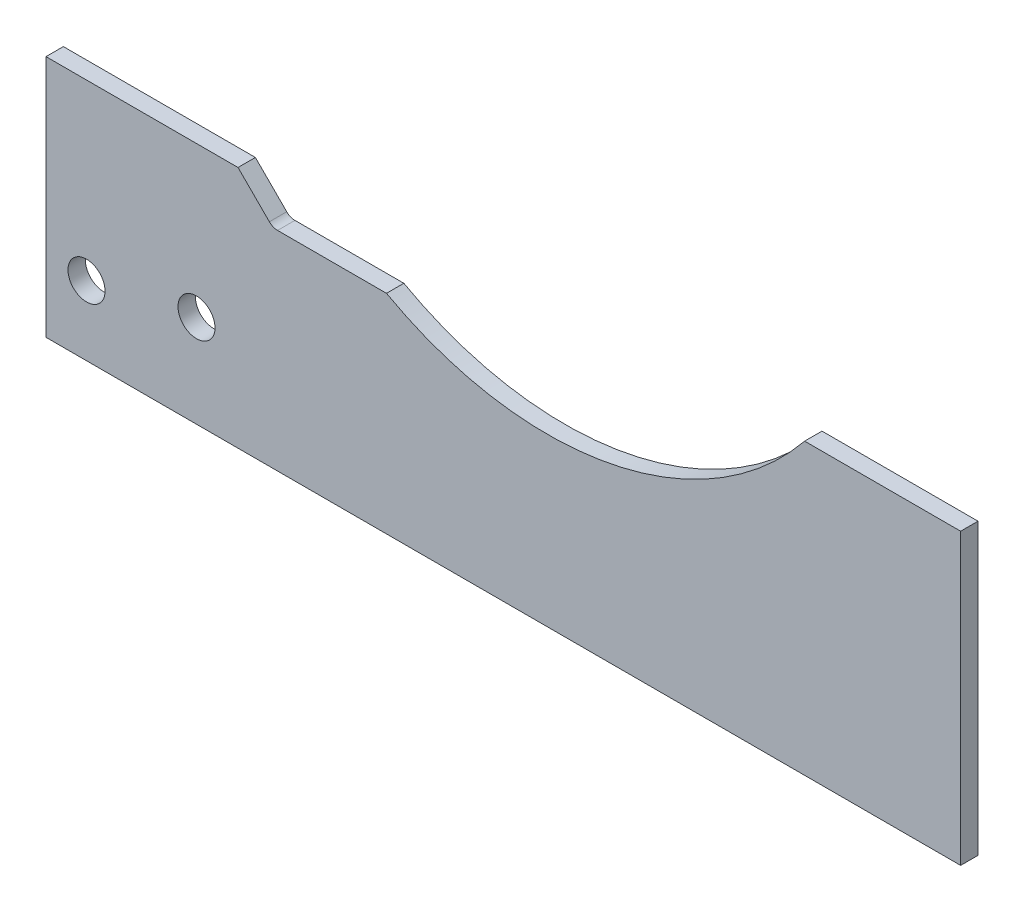
ISO-10303-21;
HEADER;
FILE_DESCRIPTION(('STEP AP214'),'2;1');
FILE_NAME('part.step','',(''),(''),'','','');
FILE_SCHEMA(('AUTOMOTIVE_DESIGN { 1 0 10303 214 1 1 1 1 }'));
ENDSEC;
DATA;
#1=APPLICATION_CONTEXT('core data for automotive mechanical design processes');
#2=APPLICATION_PROTOCOL_DEFINITION('international standard','automotive_design',2000,#1);
#3=PRODUCT_CONTEXT('',#1,'mechanical');
#4=PRODUCT('Part','Part','',(#3));
#5=PRODUCT_RELATED_PRODUCT_CATEGORY('part','',(#4));
#6=PRODUCT_DEFINITION_FORMATION('','',#4);
#7=PRODUCT_DEFINITION_CONTEXT('part definition',#1,'design');
#8=PRODUCT_DEFINITION('design','',#6,#7);
#9=PRODUCT_DEFINITION_SHAPE('','',#8);
#10=(LENGTH_UNIT() NAMED_UNIT(*) SI_UNIT(.MILLI.,.METRE.));
#11=(NAMED_UNIT(*) PLANE_ANGLE_UNIT() SI_UNIT($,.RADIAN.));
#12=(NAMED_UNIT(*) SI_UNIT($,.STERADIAN.) SOLID_ANGLE_UNIT());
#13=UNCERTAINTY_MEASURE_WITH_UNIT(LENGTH_MEASURE(1.E-05),#10,'distance_accuracy_value','');
#14=(GEOMETRIC_REPRESENTATION_CONTEXT(3) GLOBAL_UNCERTAINTY_ASSIGNED_CONTEXT((#13)) GLOBAL_UNIT_ASSIGNED_CONTEXT((#10,
#11,#12)) REPRESENTATION_CONTEXT('',''));
#15=CARTESIAN_POINT('',(0.,0.,0.));
#16=DIRECTION('',(0.,0.,1.));
#17=DIRECTION('',(1.,0.,0.));
#18=AXIS2_PLACEMENT_3D('',#15,#16,#17);
#19=CARTESIAN_POINT('',(20.0002128394422,19.0000000357668,1.5));
#20=DIRECTION('',(0.,0.,1.));
#21=DIRECTION('',(1.,0.,0.));
#22=AXIS2_PLACEMENT_3D('',#19,#20,#21);
#23=PLANE('',#22);
#24=CARTESIAN_POINT('',(3.5,6.,1.5));
#25=DIRECTION('',(0.,0.,1.));
#26=DIRECTION('',(1.,0.,0.));
#27=AXIS2_PLACEMENT_3D('',#24,#25,#26);
#28=CIRCLE('',#27,1.6);
#29=CARTESIAN_POINT('',(5.1,6.,1.5));
#30=VERTEX_POINT('',#29);
#31=EDGE_CURVE('E137',#30,#30,#28,.T.);
#32=ORIENTED_EDGE('',*,*,#31,.F.);
#33=EDGE_LOOP('',(#32));
#34=FACE_BOUND('',#33,.T.);
#35=CARTESIAN_POINT('',(20.0002128394422,19.0000000357668,1.5));
#36=DIRECTION('',(0.,0.,-1.));
#37=DIRECTION('',(1.,0.,0.));
#38=AXIS2_PLACEMENT_3D('',#35,#36,#37);
#39=CIRCLE('',#38,1.00000047576684);
#40=CARTESIAN_POINT('',(20.0002128394422,17.99999956,1.5));
#41=VERTEX_POINT('',#40);
#42=CARTESIAN_POINT('',(19.2931057218377,18.2928929181623,1.5));
#43=VERTEX_POINT('',#42);
#44=EDGE_CURVE('E150',#41,#43,#39,.T.);
#45=ORIENTED_EDGE('',*,*,#44,.T.);
#46=DIRECTION('',(-0.707106781186549,0.707106781186546,0.));
#47=VECTOR('',#46,1.);
#48=CARTESIAN_POINT('',(16.586,20.99999864,1.5));
#49=LINE('',#48,#47);
#50=CARTESIAN_POINT('',(16.586,20.99999864,1.5));
#51=VERTEX_POINT('',#50);
#52=EDGE_CURVE('E93',#43,#51,#49,.T.);
#53=ORIENTED_EDGE('',*,*,#52,.T.);
#54=DIRECTION('',(-1.,0.,0.));
#55=VECTOR('',#54,1.);
#56=CARTESIAN_POINT('',(0.,20.99999864,1.5));
#57=LINE('',#56,#55);
#58=CARTESIAN_POINT('',(0.,20.99999864,1.5));
#59=VERTEX_POINT('',#58);
#60=EDGE_CURVE('E168',#51,#59,#57,.T.);
#61=ORIENTED_EDGE('',*,*,#60,.T.);
#62=DIRECTION('',(0.,-1.,0.));
#63=VECTOR('',#62,1.);
#64=CARTESIAN_POINT('',(0.,20.99999864,1.5));
#65=LINE('',#64,#63);
#66=CARTESIAN_POINT('',(0.,0.,1.5));
#67=VERTEX_POINT('',#66);
#68=EDGE_CURVE('E185',#59,#67,#65,.T.);
#69=ORIENTED_EDGE('',*,*,#68,.T.);
#70=DIRECTION('',(1.,0.,0.));
#71=VECTOR('',#70,1.);
#72=CARTESIAN_POINT('',(0.,0.,1.5));
#73=LINE('',#72,#71);
#74=CARTESIAN_POINT('',(79.,0.,1.5));
#75=VERTEX_POINT('',#74);
#76=EDGE_CURVE('E184',#67,#75,#73,.T.);
#77=ORIENTED_EDGE('',*,*,#76,.T.);
#78=DIRECTION('',(0.,1.,0.));
#79=VECTOR('',#78,1.);
#80=CARTESIAN_POINT('',(79.,0.,1.5));
#81=LINE('',#80,#79);
#82=CARTESIAN_POINT('',(79.,25.0000008,1.5));
#83=VERTEX_POINT('',#82);
#84=EDGE_CURVE('E115',#75,#83,#81,.T.);
#85=ORIENTED_EDGE('',*,*,#84,.T.);
#86=DIRECTION('',(-1.,0.,0.));
#87=VECTOR('',#86,1.);
#88=CARTESIAN_POINT('',(79.,25.0000008,1.5));
#89=LINE('',#88,#87);
#90=CARTESIAN_POINT('',(65.5252115580482,25.0000008,1.5));
#91=VERTEX_POINT('',#90);
#92=EDGE_CURVE('E109',#83,#91,#89,.T.);
#93=ORIENTED_EDGE('',*,*,#92,.T.);
#94=CARTESIAN_POINT('',(43.3,43.,1.5));
#95=DIRECTION('',(0.,0.,-1.));
#96=DIRECTION('',(1.,0.,0.));
#97=AXIS2_PLACEMENT_3D('',#94,#95,#96);
#98=CIRCLE('',#97,28.6);
#99=CARTESIAN_POINT('',(29.4089965085312,17.99999956,1.5));
#100=VERTEX_POINT('',#99);
#101=EDGE_CURVE('E113',#91,#100,#98,.T.);
#102=ORIENTED_EDGE('',*,*,#101,.T.);
#103=DIRECTION('',(-1.,0.,0.));
#104=VECTOR('',#103,1.);
#105=CARTESIAN_POINT('',(20.0002128394422,17.99999956,1.5));
#106=LINE('',#105,#104);
#107=EDGE_CURVE('E47',#100,#41,#106,.T.);
#108=ORIENTED_EDGE('',*,*,#107,.T.);
#109=EDGE_LOOP('',(#45,#53,#61,#69,#77,#85,#93,#102,#108));
#110=FACE_BOUND('',#109,.T.);
#111=CARTESIAN_POINT('',(13.,8.,1.5));
#112=DIRECTION('',(0.,0.,1.));
#113=DIRECTION('',(1.,0.,0.));
#114=AXIS2_PLACEMENT_3D('',#111,#112,#113);
#115=CIRCLE('',#114,1.6);
#116=CARTESIAN_POINT('',(14.6,8.,1.5));
#117=VERTEX_POINT('',#116);
#118=EDGE_CURVE('E195',#117,#117,#115,.T.);
#119=ORIENTED_EDGE('',*,*,#118,.F.);
#120=EDGE_LOOP('',(#119));
#121=FACE_BOUND('',#120,.T.);
#122=ADVANCED_FACE('F30',(#34,#110,#121),#23,.T.);
#123=CARTESIAN_POINT('',(20.0002128394422,19.0000000357668,0.));
#124=DIRECTION('',(0.,0.,1.));
#125=DIRECTION('',(1.,0.,0.));
#126=AXIS2_PLACEMENT_3D('',#123,#124,#125);
#127=PLANE('',#126);
#128=CARTESIAN_POINT('',(3.5,6.,0.));
#129=DIRECTION('',(0.,0.,1.));
#130=DIRECTION('',(1.,0.,0.));
#131=AXIS2_PLACEMENT_3D('',#128,#129,#130);
#132=CIRCLE('',#131,1.6);
#133=CARTESIAN_POINT('',(5.1,6.,0.));
#134=VERTEX_POINT('',#133);
#135=EDGE_CURVE('E192',#134,#134,#132,.T.);
#136=ORIENTED_EDGE('',*,*,#135,.T.);
#137=EDGE_LOOP('',(#136));
#138=FACE_BOUND('',#137,.T.);
#139=CARTESIAN_POINT('',(20.0002128394422,19.0000000357668,0.));
#140=DIRECTION('',(0.,0.,-1.));
#141=DIRECTION('',(1.,0.,0.));
#142=AXIS2_PLACEMENT_3D('',#139,#140,#141);
#143=CIRCLE('',#142,1.00000047576684);
#144=CARTESIAN_POINT('',(20.0002128394422,17.99999956,0.));
#145=VERTEX_POINT('',#144);
#146=CARTESIAN_POINT('',(19.2931057218377,18.2928929181623,0.));
#147=VERTEX_POINT('',#146);
#148=EDGE_CURVE('E133',#145,#147,#143,.T.);
#149=ORIENTED_EDGE('',*,*,#148,.F.);
#150=DIRECTION('',(-1.,0.,0.));
#151=VECTOR('',#150,1.);
#152=CARTESIAN_POINT('',(20.0002128394422,17.99999956,0.));
#153=LINE('',#152,#151);
#154=CARTESIAN_POINT('',(29.4089965085312,17.99999956,0.));
#155=VERTEX_POINT('',#154);
#156=EDGE_CURVE('E85',#155,#145,#153,.T.);
#157=ORIENTED_EDGE('',*,*,#156,.F.);
#158=CARTESIAN_POINT('',(43.3,43.,0.));
#159=DIRECTION('',(0.,0.,-1.));
#160=DIRECTION('',(1.,0.,0.));
#161=AXIS2_PLACEMENT_3D('',#158,#159,#160);
#162=CIRCLE('',#161,28.6);
#163=CARTESIAN_POINT('',(65.5252115580482,25.0000008,0.));
#164=VERTEX_POINT('',#163);
#165=EDGE_CURVE('E79',#164,#155,#162,.T.);
#166=ORIENTED_EDGE('',*,*,#165,.F.);
#167=DIRECTION('',(-1.,0.,0.));
#168=VECTOR('',#167,1.);
#169=CARTESIAN_POINT('',(79.,25.0000008,0.));
#170=LINE('',#169,#168);
#171=CARTESIAN_POINT('',(79.,25.0000008,0.));
#172=VERTEX_POINT('',#171);
#173=EDGE_CURVE('E123',#172,#164,#170,.T.);
#174=ORIENTED_EDGE('',*,*,#173,.F.);
#175=DIRECTION('',(0.,1.,0.));
#176=VECTOR('',#175,1.);
#177=CARTESIAN_POINT('',(79.,0.,0.));
#178=LINE('',#177,#176);
#179=CARTESIAN_POINT('',(79.,0.,0.));
#180=VERTEX_POINT('',#179);
#181=EDGE_CURVE('E145',#180,#172,#178,.T.);
#182=ORIENTED_EDGE('',*,*,#181,.F.);
#183=DIRECTION('',(1.,0.,0.));
#184=VECTOR('',#183,1.);
#185=CARTESIAN_POINT('',(0.,0.,0.));
#186=LINE('',#185,#184);
#187=CARTESIAN_POINT('',(0.,0.,0.));
#188=VERTEX_POINT('',#187);
#189=EDGE_CURVE('E143',#188,#180,#186,.T.);
#190=ORIENTED_EDGE('',*,*,#189,.F.);
#191=DIRECTION('',(0.,-1.,0.));
#192=VECTOR('',#191,1.);
#193=CARTESIAN_POINT('',(0.,20.99999864,0.));
#194=LINE('',#193,#192);
#195=CARTESIAN_POINT('',(0.,20.99999864,0.));
#196=VERTEX_POINT('',#195);
#197=EDGE_CURVE('E141',#196,#188,#194,.T.);
#198=ORIENTED_EDGE('',*,*,#197,.F.);
#199=DIRECTION('',(-1.,0.,0.));
#200=VECTOR('',#199,1.);
#201=CARTESIAN_POINT('',(0.,20.99999864,0.));
#202=LINE('',#201,#200);
#203=CARTESIAN_POINT('',(16.586,20.99999864,0.));
#204=VERTEX_POINT('',#203);
#205=EDGE_CURVE('E139',#204,#196,#202,.T.);
#206=ORIENTED_EDGE('',*,*,#205,.F.);
#207=DIRECTION('',(-0.707106781186549,0.707106781186546,0.));
#208=VECTOR('',#207,1.);
#209=CARTESIAN_POINT('',(16.586,20.99999864,0.));
#210=LINE('',#209,#208);
#211=EDGE_CURVE('E136',#147,#204,#210,.T.);
#212=ORIENTED_EDGE('',*,*,#211,.F.);
#213=EDGE_LOOP('',(#149,#157,#166,#174,#182,#190,#198,#206,#212));
#214=FACE_BOUND('',#213,.T.);
#215=CARTESIAN_POINT('',(13.,8.,0.));
#216=DIRECTION('',(0.,0.,1.));
#217=DIRECTION('',(1.,0.,0.));
#218=AXIS2_PLACEMENT_3D('',#215,#216,#217);
#219=CIRCLE('',#218,1.6);
#220=CARTESIAN_POINT('',(14.6,8.,0.));
#221=VERTEX_POINT('',#220);
#222=EDGE_CURVE('E198',#221,#221,#219,.T.);
#223=ORIENTED_EDGE('',*,*,#222,.T.);
#224=EDGE_LOOP('',(#223));
#225=FACE_BOUND('',#224,.T.);
#226=ADVANCED_FACE('F172',(#138,#214,#225),#127,.F.);
#227=CARTESIAN_POINT('',(20.0002128394422,19.0000000357668,1.5));
#228=DIRECTION('',(0.,0.,-1.));
#229=DIRECTION('',(-1.,0.,0.));
#230=AXIS2_PLACEMENT_3D('',#227,#228,#229);
#231=CYLINDRICAL_SURFACE('',#230,1.00000047576684);
#232=ORIENTED_EDGE('',*,*,#148,.T.);
#233=DIRECTION('',(0.,0.,-1.));
#234=VECTOR('',#233,1.);
#235=CARTESIAN_POINT('',(19.2931057218377,18.2928929181623,1.5));
#236=LINE('',#235,#234);
#237=EDGE_CURVE('E11',#43,#147,#236,.T.);
#238=ORIENTED_EDGE('',*,*,#237,.F.);
#239=ORIENTED_EDGE('',*,*,#44,.F.);
#240=DIRECTION('',(0.,0.,-1.));
#241=VECTOR('',#240,1.);
#242=CARTESIAN_POINT('',(20.0002128394422,17.99999956,1.5));
#243=LINE('',#242,#241);
#244=EDGE_CURVE('E129',#41,#145,#243,.T.);
#245=ORIENTED_EDGE('',*,*,#244,.T.);
#246=EDGE_LOOP('',(#232,#238,#239,#245));
#247=FACE_BOUND('',#246,.T.);
#248=ADVANCED_FACE('F32',(#247),#231,.F.);
#249=CARTESIAN_POINT('',(16.586,20.99999864,1.5));
#250=DIRECTION('',(-0.707106781186546,-0.707106781186549,0.));
#251=DIRECTION('',(0.707106781186549,-0.707106781186546,0.));
#252=AXIS2_PLACEMENT_3D('',#249,#250,#251);
#253=PLANE('',#252);
#254=ORIENTED_EDGE('',*,*,#211,.T.);
#255=DIRECTION('',(0.,0.,-1.));
#256=VECTOR('',#255,1.);
#257=CARTESIAN_POINT('',(16.586,20.99999864,1.5));
#258=LINE('',#257,#256);
#259=EDGE_CURVE('E39',#51,#204,#258,.T.);
#260=ORIENTED_EDGE('',*,*,#259,.F.);
#261=ORIENTED_EDGE('',*,*,#52,.F.);
#262=ORIENTED_EDGE('',*,*,#237,.T.);
#263=EDGE_LOOP('',(#254,#260,#261,#262));
#264=FACE_BOUND('',#263,.T.);
#265=ADVANCED_FACE('F235',(#264),#253,.F.);
#266=CARTESIAN_POINT('',(0.,20.99999864,1.5));
#267=DIRECTION('',(0.,-1.,0.));
#268=DIRECTION('',(0.,0.,-1.));
#269=AXIS2_PLACEMENT_3D('',#266,#267,#268);
#270=PLANE('',#269);
#271=ORIENTED_EDGE('',*,*,#205,.T.);
#272=DIRECTION('',(0.,0.,-1.));
#273=VECTOR('',#272,1.);
#274=CARTESIAN_POINT('',(0.,20.99999864,1.5));
#275=LINE('',#274,#273);
#276=EDGE_CURVE('E160',#59,#196,#275,.T.);
#277=ORIENTED_EDGE('',*,*,#276,.F.);
#278=ORIENTED_EDGE('',*,*,#60,.F.);
#279=ORIENTED_EDGE('',*,*,#259,.T.);
#280=EDGE_LOOP('',(#271,#277,#278,#279));
#281=FACE_BOUND('',#280,.T.);
#282=ADVANCED_FACE('F166',(#281),#270,.F.);
#283=CARTESIAN_POINT('',(0.,20.99999864,1.5));
#284=DIRECTION('',(1.,0.,0.));
#285=DIRECTION('',(0.,1.,0.));
#286=AXIS2_PLACEMENT_3D('',#283,#284,#285);
#287=PLANE('',#286);
#288=ORIENTED_EDGE('',*,*,#197,.T.);
#289=DIRECTION('',(0.,0.,-1.));
#290=VECTOR('',#289,1.);
#291=CARTESIAN_POINT('',(0.,0.,1.5));
#292=LINE('',#291,#290);
#293=EDGE_CURVE('E157',#67,#188,#292,.T.);
#294=ORIENTED_EDGE('',*,*,#293,.F.);
#295=ORIENTED_EDGE('',*,*,#68,.F.);
#296=ORIENTED_EDGE('',*,*,#276,.T.);
#297=EDGE_LOOP('',(#288,#294,#295,#296));
#298=FACE_BOUND('',#297,.T.);
#299=ADVANCED_FACE('F178',(#298),#287,.F.);
#300=CARTESIAN_POINT('',(0.,0.,1.5));
#301=DIRECTION('',(0.,1.,0.));
#302=DIRECTION('',(0.,0.,1.));
#303=AXIS2_PLACEMENT_3D('',#300,#301,#302);
#304=PLANE('',#303);
#305=ORIENTED_EDGE('',*,*,#189,.T.);
#306=DIRECTION('',(0.,0.,-1.));
#307=VECTOR('',#306,1.);
#308=CARTESIAN_POINT('',(79.,0.,1.5));
#309=LINE('',#308,#307);
#310=EDGE_CURVE('E154',#75,#180,#309,.T.);
#311=ORIENTED_EDGE('',*,*,#310,.F.);
#312=ORIENTED_EDGE('',*,*,#76,.F.);
#313=ORIENTED_EDGE('',*,*,#293,.T.);
#314=EDGE_LOOP('',(#305,#311,#312,#313));
#315=FACE_BOUND('',#314,.T.);
#316=ADVANCED_FACE('F182',(#315),#304,.F.);
#317=CARTESIAN_POINT('',(79.,0.,1.5));
#318=DIRECTION('',(-1.,0.,0.));
#319=DIRECTION('',(0.,0.,1.));
#320=AXIS2_PLACEMENT_3D('',#317,#318,#319);
#321=PLANE('',#320);
#322=ORIENTED_EDGE('',*,*,#181,.T.);
#323=DIRECTION('',(0.,0.,-1.));
#324=VECTOR('',#323,1.);
#325=CARTESIAN_POINT('',(79.,25.0000008,1.5));
#326=LINE('',#325,#324);
#327=EDGE_CURVE('E124',#83,#172,#326,.T.);
#328=ORIENTED_EDGE('',*,*,#327,.F.);
#329=ORIENTED_EDGE('',*,*,#84,.F.);
#330=ORIENTED_EDGE('',*,*,#310,.T.);
#331=EDGE_LOOP('',(#322,#328,#329,#330));
#332=FACE_BOUND('',#331,.T.);
#333=ADVANCED_FACE('F226',(#332),#321,.F.);
#334=CARTESIAN_POINT('',(79.,25.0000008,1.5));
#335=DIRECTION('',(0.,-1.,0.));
#336=DIRECTION('',(1.,0.,0.));
#337=AXIS2_PLACEMENT_3D('',#334,#335,#336);
#338=PLANE('',#337);
#339=ORIENTED_EDGE('',*,*,#173,.T.);
#340=DIRECTION('',(0.,0.,-1.));
#341=VECTOR('',#340,1.);
#342=CARTESIAN_POINT('',(65.5252115580482,25.0000008,1.5));
#343=LINE('',#342,#341);
#344=EDGE_CURVE('E120',#91,#164,#343,.T.);
#345=ORIENTED_EDGE('',*,*,#344,.F.);
#346=ORIENTED_EDGE('',*,*,#92,.F.);
#347=ORIENTED_EDGE('',*,*,#327,.T.);
#348=EDGE_LOOP('',(#339,#345,#346,#347));
#349=FACE_BOUND('',#348,.T.);
#350=ADVANCED_FACE('F121',(#349),#338,.F.);
#351=CARTESIAN_POINT('',(43.3,43.,1.5));
#352=DIRECTION('',(0.,0.,-1.));
#353=DIRECTION('',(-1.,0.,0.));
#354=AXIS2_PLACEMENT_3D('',#351,#352,#353);
#355=CYLINDRICAL_SURFACE('',#354,28.6);
#356=ORIENTED_EDGE('',*,*,#165,.T.);
#357=DIRECTION('',(0.,0.,-1.));
#358=VECTOR('',#357,1.);
#359=CARTESIAN_POINT('',(29.4089965085312,17.99999956,1.5));
#360=LINE('',#359,#358);
#361=EDGE_CURVE('E125',#100,#155,#360,.T.);
#362=ORIENTED_EDGE('',*,*,#361,.F.);
#363=ORIENTED_EDGE('',*,*,#101,.F.);
#364=ORIENTED_EDGE('',*,*,#344,.T.);
#365=EDGE_LOOP('',(#356,#362,#363,#364));
#366=FACE_BOUND('',#365,.T.);
#367=ADVANCED_FACE('F127',(#366),#355,.F.);
#368=CARTESIAN_POINT('',(20.0002128394422,17.99999956,1.5));
#369=DIRECTION('',(0.,-1.,0.));
#370=DIRECTION('',(0.,0.,-1.));
#371=AXIS2_PLACEMENT_3D('',#368,#369,#370);
#372=PLANE('',#371);
#373=ORIENTED_EDGE('',*,*,#156,.T.);
#374=ORIENTED_EDGE('',*,*,#244,.F.);
#375=ORIENTED_EDGE('',*,*,#107,.F.);
#376=ORIENTED_EDGE('',*,*,#361,.T.);
#377=EDGE_LOOP('',(#373,#374,#375,#376));
#378=FACE_BOUND('',#377,.T.);
#379=ADVANCED_FACE('F219',(#378),#372,.F.);
#380=CARTESIAN_POINT('',(3.5,6.,1.5));
#381=DIRECTION('',(0.,0.,-1.));
#382=DIRECTION('',(-1.,0.,0.));
#383=AXIS2_PLACEMENT_3D('',#380,#381,#382);
#384=CYLINDRICAL_SURFACE('',#383,1.6);
#385=ORIENTED_EDGE('',*,*,#31,.T.);
#386=EDGE_LOOP('',(#385));
#387=FACE_BOUND('',#386,.T.);
#388=ORIENTED_EDGE('',*,*,#135,.F.);
#389=EDGE_LOOP('',(#388));
#390=FACE_BOUND('',#389,.T.);
#391=ADVANCED_FACE('F216',(#387,#390),#384,.F.);
#392=CARTESIAN_POINT('',(13.,8.,1.5));
#393=DIRECTION('',(0.,0.,-1.));
#394=DIRECTION('',(-1.,0.,0.));
#395=AXIS2_PLACEMENT_3D('',#392,#393,#394);
#396=CYLINDRICAL_SURFACE('',#395,1.6);
#397=ORIENTED_EDGE('',*,*,#118,.T.);
#398=EDGE_LOOP('',(#397));
#399=FACE_BOUND('',#398,.T.);
#400=ORIENTED_EDGE('',*,*,#222,.F.);
#401=EDGE_LOOP('',(#400));
#402=FACE_BOUND('',#401,.T.);
#403=ADVANCED_FACE('F204',(#399,#402),#396,.F.);
#404=CLOSED_SHELL('',(#122,#226,#248,#265,#282,#299,#316,#333,#350,#367,#379,#391,#403));
#405=MANIFOLD_SOLID_BREP('B2',#404);
#406=ADVANCED_BREP_SHAPE_REPRESENTATION('',(#18,#405),#14);
#407=SHAPE_DEFINITION_REPRESENTATION(#9,#406);
ENDSEC;
END-ISO-10303-21;
